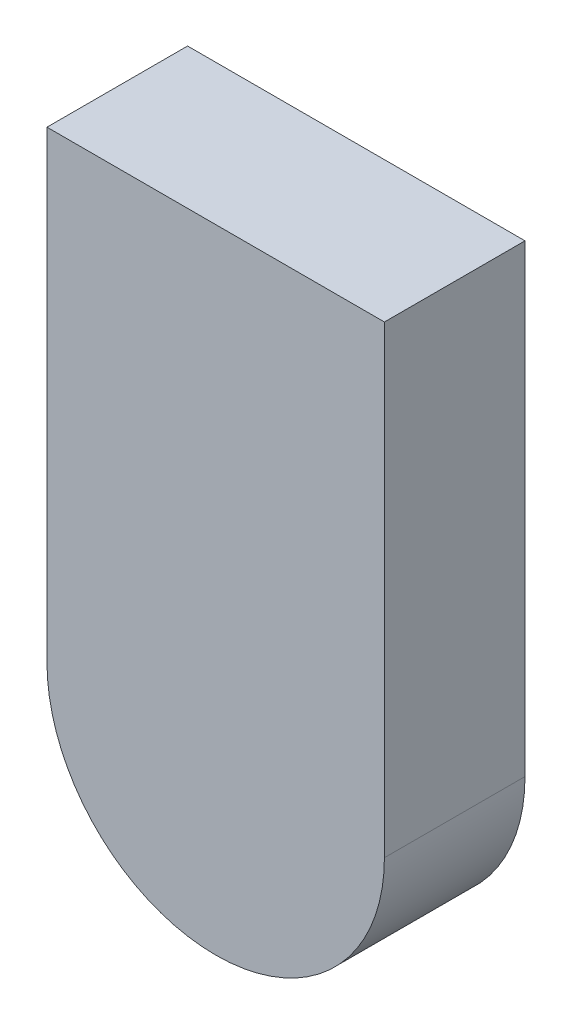
ISO-10303-21;
HEADER;
FILE_DESCRIPTION(('STEP AP214'),'2;1');
FILE_NAME('part.step','',(''),(''),'','','');
FILE_SCHEMA(('AUTOMOTIVE_DESIGN { 1 0 10303 214 1 1 1 1 }'));
ENDSEC;
DATA;
#1=APPLICATION_CONTEXT('core data for automotive mechanical design processes');
#2=APPLICATION_PROTOCOL_DEFINITION('international standard','automotive_design',2000,#1);
#3=PRODUCT_CONTEXT('',#1,'mechanical');
#4=PRODUCT('Part','Part','',(#3));
#5=PRODUCT_RELATED_PRODUCT_CATEGORY('part','',(#4));
#6=PRODUCT_DEFINITION_FORMATION('','',#4);
#7=PRODUCT_DEFINITION_CONTEXT('part definition',#1,'design');
#8=PRODUCT_DEFINITION('design','',#6,#7);
#9=PRODUCT_DEFINITION_SHAPE('','',#8);
#10=(LENGTH_UNIT() NAMED_UNIT(*) SI_UNIT(.MILLI.,.METRE.));
#11=(NAMED_UNIT(*) PLANE_ANGLE_UNIT() SI_UNIT($,.RADIAN.));
#12=(NAMED_UNIT(*) SI_UNIT($,.STERADIAN.) SOLID_ANGLE_UNIT());
#13=UNCERTAINTY_MEASURE_WITH_UNIT(LENGTH_MEASURE(1.E-05),#10,'distance_accuracy_value','');
#14=(GEOMETRIC_REPRESENTATION_CONTEXT(3) GLOBAL_UNCERTAINTY_ASSIGNED_CONTEXT((#13)) GLOBAL_UNIT_ASSIGNED_CONTEXT((#10,
#11,#12)) REPRESENTATION_CONTEXT('',''));
#15=CARTESIAN_POINT('',(0.,0.,0.));
#16=DIRECTION('',(0.,0.,1.));
#17=DIRECTION('',(1.,0.,0.));
#18=AXIS2_PLACEMENT_3D('',#15,#16,#17);
#19=CARTESIAN_POINT('',(2.13,4.05,0.));
#20=DIRECTION('',(0.,1.,0.));
#21=DIRECTION('',(1.,0.,0.));
#22=AXIS2_PLACEMENT_3D('',#19,#20,#21);
#23=PLANE('',#22);
#24=DIRECTION('',(0.,0.,1.));
#25=VECTOR('',#24,1.);
#26=CARTESIAN_POINT('',(2.13,4.05,0.));
#27=LINE('',#26,#25);
#28=CARTESIAN_POINT('',(2.13,4.05,0.));
#29=VERTEX_POINT('',#28);
#30=CARTESIAN_POINT('',(2.13,4.05,0.1));
#31=VERTEX_POINT('',#30);
#32=EDGE_CURVE('E11',#29,#31,#27,.T.);
#33=ORIENTED_EDGE('',*,*,#32,.T.);
#34=DIRECTION('',(1.,0.,0.));
#35=VECTOR('',#34,1.);
#36=CARTESIAN_POINT('',(2.13,4.05,0.1));
#37=LINE('',#36,#35);
#38=CARTESIAN_POINT('',(2.37,4.05,0.1));
#39=VERTEX_POINT('',#38);
#40=EDGE_CURVE('E24',#31,#39,#37,.T.);
#41=ORIENTED_EDGE('',*,*,#40,.T.);
#42=DIRECTION('',(0.,0.,1.));
#43=VECTOR('',#42,1.);
#44=CARTESIAN_POINT('',(2.37,4.05,0.));
#45=LINE('',#44,#43);
#46=CARTESIAN_POINT('',(2.37,4.05,0.));
#47=VERTEX_POINT('',#46);
#48=EDGE_CURVE('E85',#47,#39,#45,.T.);
#49=ORIENTED_EDGE('',*,*,#48,.F.);
#50=DIRECTION('',(1.,0.,0.));
#51=VECTOR('',#50,1.);
#52=CARTESIAN_POINT('',(2.13,4.05,0.));
#53=LINE('',#52,#51);
#54=EDGE_CURVE('E82',#29,#47,#53,.T.);
#55=ORIENTED_EDGE('',*,*,#54,.F.);
#56=EDGE_LOOP('',(#33,#41,#49,#55));
#57=FACE_BOUND('',#56,.T.);
#58=ADVANCED_FACE('F17',(#57),#23,.T.);
#59=CARTESIAN_POINT('',(2.37,4.05,0.));
#60=DIRECTION('',(1.,0.,0.));
#61=DIRECTION('',(0.,-1.,0.));
#62=AXIS2_PLACEMENT_3D('',#59,#60,#61);
#63=PLANE('',#62);
#64=ORIENTED_EDGE('',*,*,#48,.T.);
#65=DIRECTION('',(0.,-1.,0.));
#66=VECTOR('',#65,1.);
#67=CARTESIAN_POINT('',(2.37,4.05,0.1));
#68=LINE('',#67,#66);
#69=CARTESIAN_POINT('',(2.37,3.72,0.1));
#70=VERTEX_POINT('',#69);
#71=EDGE_CURVE('E80',#39,#70,#68,.T.);
#72=ORIENTED_EDGE('',*,*,#71,.T.);
#73=DIRECTION('',(0.,0.,1.));
#74=VECTOR('',#73,1.);
#75=CARTESIAN_POINT('',(2.37,3.72,0.));
#76=LINE('',#75,#74);
#77=CARTESIAN_POINT('',(2.37,3.72,0.));
#78=VERTEX_POINT('',#77);
#79=EDGE_CURVE('E60',#78,#70,#76,.T.);
#80=ORIENTED_EDGE('',*,*,#79,.F.);
#81=DIRECTION('',(0.,-1.,0.));
#82=VECTOR('',#81,1.);
#83=CARTESIAN_POINT('',(2.37,4.05,0.));
#84=LINE('',#83,#82);
#85=EDGE_CURVE('E76',#47,#78,#84,.T.);
#86=ORIENTED_EDGE('',*,*,#85,.F.);
#87=EDGE_LOOP('',(#64,#72,#80,#86));
#88=FACE_BOUND('',#87,.T.);
#89=ADVANCED_FACE('F89',(#88),#63,.T.);
#90=CARTESIAN_POINT('',(2.25,3.72,0.));
#91=DIRECTION('',(0.,0.,-1.));
#92=DIRECTION('',(1.,0.,0.));
#93=AXIS2_PLACEMENT_3D('',#90,#91,#92);
#94=CYLINDRICAL_SURFACE('',#93,0.12);
#95=CARTESIAN_POINT('',(2.25,3.72,0.));
#96=DIRECTION('',(0.,0.,1.));
#97=DIRECTION('',(1.,0.,0.));
#98=AXIS2_PLACEMENT_3D('',#95,#96,#97);
#99=CIRCLE('',#98,0.12);
#100=CARTESIAN_POINT('',(2.13,3.72,0.));
#101=VERTEX_POINT('',#100);
#102=EDGE_CURVE('E64',#101,#78,#99,.T.);
#103=ORIENTED_EDGE('',*,*,#102,.T.);
#104=ORIENTED_EDGE('',*,*,#79,.T.);
#105=CARTESIAN_POINT('',(2.25,3.72,0.1));
#106=DIRECTION('',(0.,0.,1.));
#107=DIRECTION('',(1.,0.,0.));
#108=AXIS2_PLACEMENT_3D('',#105,#106,#107);
#109=CIRCLE('',#108,0.12);
#110=CARTESIAN_POINT('',(2.13,3.72,0.1));
#111=VERTEX_POINT('',#110);
#112=EDGE_CURVE('E55',#111,#70,#109,.T.);
#113=ORIENTED_EDGE('',*,*,#112,.F.);
#114=DIRECTION('',(0.,0.,1.));
#115=VECTOR('',#114,1.);
#116=CARTESIAN_POINT('',(2.13,3.72,0.));
#117=LINE('',#116,#115);
#118=EDGE_CURVE('E59',#101,#111,#117,.T.);
#119=ORIENTED_EDGE('',*,*,#118,.F.);
#120=EDGE_LOOP('',(#103,#104,#113,#119));
#121=FACE_BOUND('',#120,.T.);
#122=ADVANCED_FACE('F58',(#121),#94,.T.);
#123=CARTESIAN_POINT('',(2.13,4.05,0.));
#124=DIRECTION('',(1.,0.,0.));
#125=DIRECTION('',(0.,-1.,0.));
#126=AXIS2_PLACEMENT_3D('',#123,#124,#125);
#127=PLANE('',#126);
#128=DIRECTION('',(0.,-1.,0.));
#129=VECTOR('',#128,1.);
#130=CARTESIAN_POINT('',(2.13,4.05,0.));
#131=LINE('',#130,#129);
#132=EDGE_CURVE('E69',#29,#101,#131,.T.);
#133=ORIENTED_EDGE('',*,*,#132,.T.);
#134=ORIENTED_EDGE('',*,*,#118,.T.);
#135=DIRECTION('',(0.,-1.,0.));
#136=VECTOR('',#135,1.);
#137=CARTESIAN_POINT('',(2.13,4.05,0.1));
#138=LINE('',#137,#136);
#139=EDGE_CURVE('E67',#31,#111,#138,.T.);
#140=ORIENTED_EDGE('',*,*,#139,.F.);
#141=ORIENTED_EDGE('',*,*,#32,.F.);
#142=EDGE_LOOP('',(#133,#134,#140,#141));
#143=FACE_BOUND('',#142,.T.);
#144=ADVANCED_FACE('F66',(#143),#127,.F.);
#145=CARTESIAN_POINT('',(2.25,3.849490847913,0.));
#146=DIRECTION('',(0.,0.,-1.));
#147=DIRECTION('',(-1.,0.,0.));
#148=AXIS2_PLACEMENT_3D('',#145,#146,#147);
#149=PLANE('',#148);
#150=ORIENTED_EDGE('',*,*,#54,.T.);
#151=ORIENTED_EDGE('',*,*,#85,.T.);
#152=ORIENTED_EDGE('',*,*,#102,.F.);
#153=ORIENTED_EDGE('',*,*,#132,.F.);
#154=EDGE_LOOP('',(#150,#151,#152,#153));
#155=FACE_BOUND('',#154,.T.);
#156=ADVANCED_FACE('F91',(#155),#149,.T.);
#157=CARTESIAN_POINT('',(2.25,3.849490847913,0.1));
#158=DIRECTION('',(0.,0.,-1.));
#159=DIRECTION('',(-1.,0.,0.));
#160=AXIS2_PLACEMENT_3D('',#157,#158,#159);
#161=PLANE('',#160);
#162=ORIENTED_EDGE('',*,*,#139,.T.);
#163=ORIENTED_EDGE('',*,*,#112,.T.);
#164=ORIENTED_EDGE('',*,*,#71,.F.);
#165=ORIENTED_EDGE('',*,*,#40,.F.);
#166=EDGE_LOOP('',(#162,#163,#164,#165));
#167=FACE_BOUND('',#166,.T.);
#168=ADVANCED_FACE('F71',(#167),#161,.F.);
#169=CLOSED_SHELL('',(#58,#89,#122,#144,#156,#168));
#170=MANIFOLD_SOLID_BREP('B1',#169);
#171=ADVANCED_BREP_SHAPE_REPRESENTATION('',(#18,#170),#14);
#172=SHAPE_DEFINITION_REPRESENTATION(#9,#171);
ENDSEC;
END-ISO-10303-21;
